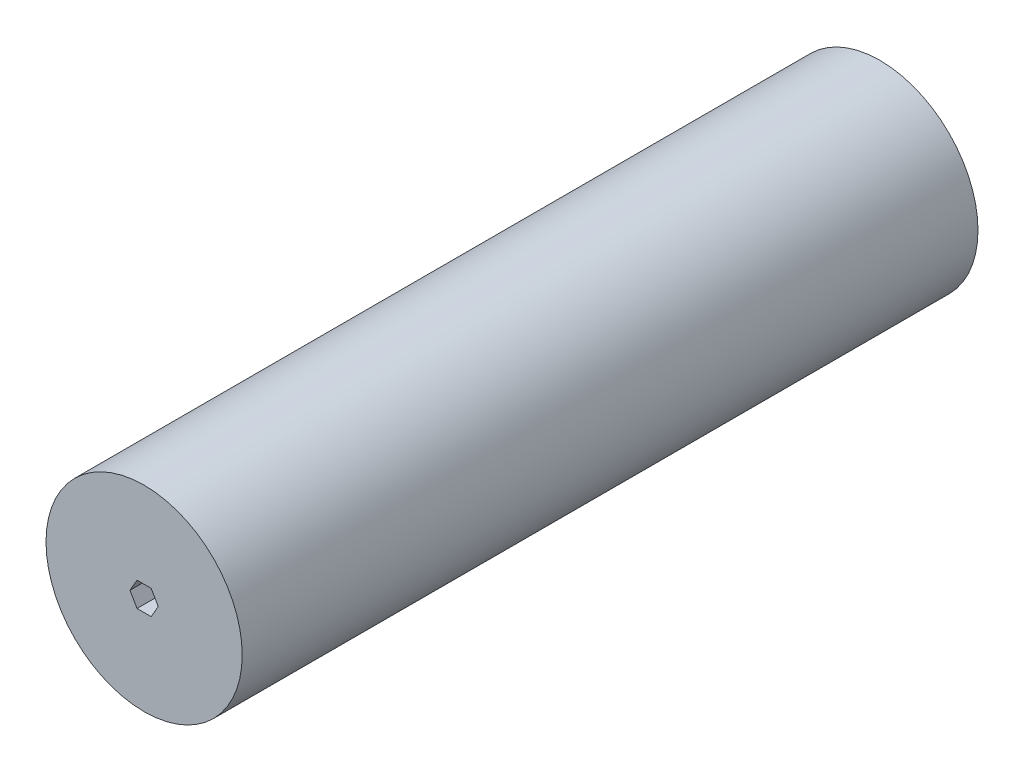
ISO-10303-21;
HEADER;
FILE_DESCRIPTION(('STEP AP214'),'2;1');
FILE_NAME('part.step','',(''),(''),'','','');
FILE_SCHEMA(('AUTOMOTIVE_DESIGN { 1 0 10303 214 1 1 1 1 }'));
ENDSEC;
DATA;
#1=APPLICATION_CONTEXT('core data for automotive mechanical design processes');
#2=APPLICATION_PROTOCOL_DEFINITION('international standard','automotive_design',2000,#1);
#3=PRODUCT_CONTEXT('',#1,'mechanical');
#4=PRODUCT('Part','Part','',(#3));
#5=PRODUCT_RELATED_PRODUCT_CATEGORY('part','',(#4));
#6=PRODUCT_DEFINITION_FORMATION('','',#4);
#7=PRODUCT_DEFINITION_CONTEXT('part definition',#1,'design');
#8=PRODUCT_DEFINITION('design','',#6,#7);
#9=PRODUCT_DEFINITION_SHAPE('','',#8);
#10=(LENGTH_UNIT() NAMED_UNIT(*) SI_UNIT(.MILLI.,.METRE.));
#11=(NAMED_UNIT(*) PLANE_ANGLE_UNIT() SI_UNIT($,.RADIAN.));
#12=(NAMED_UNIT(*) SI_UNIT($,.STERADIAN.) SOLID_ANGLE_UNIT());
#13=UNCERTAINTY_MEASURE_WITH_UNIT(LENGTH_MEASURE(1.E-05),#10,'distance_accuracy_value','');
#14=(GEOMETRIC_REPRESENTATION_CONTEXT(3) GLOBAL_UNCERTAINTY_ASSIGNED_CONTEXT((#13)) GLOBAL_UNIT_ASSIGNED_CONTEXT((#10,
#11,#12)) REPRESENTATION_CONTEXT('',''));
#15=CARTESIAN_POINT('',(0.,0.,0.));
#16=DIRECTION('',(0.,0.,1.));
#17=DIRECTION('',(1.,0.,0.));
#18=AXIS2_PLACEMENT_3D('',#15,#16,#17);
#19=CARTESIAN_POINT('',(0.,0.,380.999999999999));
#20=DIRECTION('',(0.,0.,-1.));
#21=DIRECTION('',(-1.,0.,0.));
#22=AXIS2_PLACEMENT_3D('',#19,#20,#21);
#23=CYLINDRICAL_SURFACE('',#22,50.8);
#24=CARTESIAN_POINT('',(0.,0.,380.999999999999));
#25=DIRECTION('',(0.,0.,1.));
#26=DIRECTION('',(1.,0.,0.));
#27=AXIS2_PLACEMENT_3D('',#24,#25,#26);
#28=CIRCLE('',#27,50.8);
#29=CARTESIAN_POINT('',(50.8,0.,380.999999999999));
#30=VERTEX_POINT('',#29);
#31=EDGE_CURVE('E11',#30,#30,#28,.T.);
#32=ORIENTED_EDGE('',*,*,#31,.F.);
#33=EDGE_LOOP('',(#32));
#34=FACE_BOUND('',#33,.T.);
#35=CARTESIAN_POINT('',(0.,0.,0.));
#36=DIRECTION('',(0.,0.,1.));
#37=DIRECTION('',(1.,0.,0.));
#38=AXIS2_PLACEMENT_3D('',#35,#36,#37);
#39=CIRCLE('',#38,50.8);
#40=CARTESIAN_POINT('',(50.8,0.,0.));
#41=VERTEX_POINT('',#40);
#42=EDGE_CURVE('E42',#41,#41,#39,.T.);
#43=ORIENTED_EDGE('',*,*,#42,.T.);
#44=EDGE_LOOP('',(#43));
#45=FACE_BOUND('',#44,.T.);
#46=ADVANCED_FACE('F39',(#34,#45),#23,.T.);
#47=CARTESIAN_POINT('',(0.,0.,380.999999999999));
#48=DIRECTION('',(0.,0.,1.));
#49=DIRECTION('',(1.,0.,0.));
#50=AXIS2_PLACEMENT_3D('',#47,#48,#49);
#51=PLANE('',#50);
#52=DIRECTION('',(-0.5,0.866025403784439,0.));
#53=VECTOR('',#52,1.);
#54=CARTESIAN_POINT('',(5.49926131403119,3.175,380.999999999999));
#55=LINE('',#54,#53);
#56=CARTESIAN_POINT('',(7.33234841870825,0.,380.999999999999));
#57=VERTEX_POINT('',#56);
#58=CARTESIAN_POINT('',(3.66617420935413,6.35,380.999999999999));
#59=VERTEX_POINT('',#58);
#60=EDGE_CURVE('E98',#57,#59,#55,.T.);
#61=ORIENTED_EDGE('',*,*,#60,.F.);
#62=DIRECTION('',(0.5,0.866025403784439,0.));
#63=VECTOR('',#62,1.);
#64=CARTESIAN_POINT('',(5.49926131403119,-3.175,380.999999999999));
#65=LINE('',#64,#63);
#66=CARTESIAN_POINT('',(3.66617420935413,-6.35000000000001,380.999999999999));
#67=VERTEX_POINT('',#66);
#68=EDGE_CURVE('E157',#67,#57,#65,.T.);
#69=ORIENTED_EDGE('',*,*,#68,.F.);
#70=DIRECTION('',(1.,0.,0.));
#71=VECTOR('',#70,1.);
#72=CARTESIAN_POINT('',(0.,-6.35000000000001,380.999999999999));
#73=LINE('',#72,#71);
#74=CARTESIAN_POINT('',(-3.66617420935411,-6.35000000000001,380.999999999999));
#75=VERTEX_POINT('',#74);
#76=EDGE_CURVE('E154',#75,#67,#73,.T.);
#77=ORIENTED_EDGE('',*,*,#76,.F.);
#78=DIRECTION('',(0.5,-0.866025403784439,0.));
#79=VECTOR('',#78,1.);
#80=CARTESIAN_POINT('',(-5.49926131403118,-3.175,380.999999999999));
#81=LINE('',#80,#79);
#82=CARTESIAN_POINT('',(-7.33234841870824,0.,380.999999999999));
#83=VERTEX_POINT('',#82);
#84=EDGE_CURVE('E151',#83,#75,#81,.T.);
#85=ORIENTED_EDGE('',*,*,#84,.F.);
#86=DIRECTION('',(-0.5,-0.866025403784439,0.));
#87=VECTOR('',#86,1.);
#88=CARTESIAN_POINT('',(-5.49926131403118,3.17499999999999,380.999999999999));
#89=LINE('',#88,#87);
#90=CARTESIAN_POINT('',(-3.66617420935412,6.35,380.999999999999));
#91=VERTEX_POINT('',#90);
#92=EDGE_CURVE('E148',#91,#83,#89,.T.);
#93=ORIENTED_EDGE('',*,*,#92,.F.);
#94=DIRECTION('',(-1.,0.,0.));
#95=VECTOR('',#94,1.);
#96=CARTESIAN_POINT('',(0.,6.35,380.999999999999));
#97=LINE('',#96,#95);
#98=EDGE_CURVE('E131',#59,#91,#97,.T.);
#99=ORIENTED_EDGE('',*,*,#98,.F.);
#100=EDGE_LOOP('',(#61,#69,#77,#85,#93,#99));
#101=FACE_BOUND('',#100,.T.);
#102=ORIENTED_EDGE('',*,*,#31,.T.);
#103=EDGE_LOOP('',(#102));
#104=FACE_BOUND('',#103,.T.);
#105=ADVANCED_FACE('F166',(#101,#104),#51,.T.);
#106=CARTESIAN_POINT('',(0.,0.,0.));
#107=DIRECTION('',(0.,0.,1.));
#108=DIRECTION('',(1.,0.,0.));
#109=AXIS2_PLACEMENT_3D('',#106,#107,#108);
#110=PLANE('',#109);
#111=DIRECTION('',(0.5,0.866025403784438,0.));
#112=VECTOR('',#111,1.);
#113=CARTESIAN_POINT('',(3.66617420935413,-6.35000000000001,0.));
#114=LINE('',#113,#112);
#115=CARTESIAN_POINT('',(3.66617420935413,-6.35000000000001,0.));
#116=VERTEX_POINT('',#115);
#117=CARTESIAN_POINT('',(7.33234841870825,0.,0.));
#118=VERTEX_POINT('',#117);
#119=EDGE_CURVE('E102',#116,#118,#114,.T.);
#120=ORIENTED_EDGE('',*,*,#119,.T.);
#121=DIRECTION('',(-0.5,0.866025403784438,0.));
#122=VECTOR('',#121,1.);
#123=CARTESIAN_POINT('',(7.33234841870825,0.,0.));
#124=LINE('',#123,#122);
#125=CARTESIAN_POINT('',(3.66617420935413,6.35,0.));
#126=VERTEX_POINT('',#125);
#127=EDGE_CURVE('E95',#118,#126,#124,.T.);
#128=ORIENTED_EDGE('',*,*,#127,.T.);
#129=DIRECTION('',(-1.,0.,0.));
#130=VECTOR('',#129,1.);
#131=CARTESIAN_POINT('',(3.66617420935413,6.35,0.));
#132=LINE('',#131,#130);
#133=CARTESIAN_POINT('',(-3.66617420935412,6.35,0.));
#134=VERTEX_POINT('',#133);
#135=EDGE_CURVE('E105',#126,#134,#132,.T.);
#136=ORIENTED_EDGE('',*,*,#135,.T.);
#137=DIRECTION('',(-0.5,-0.866025403784439,0.));
#138=VECTOR('',#137,1.);
#139=CARTESIAN_POINT('',(-3.66617420935412,6.35,0.));
#140=LINE('',#139,#138);
#141=CARTESIAN_POINT('',(-7.33234841870824,0.,0.));
#142=VERTEX_POINT('',#141);
#143=EDGE_CURVE('E62',#134,#142,#140,.T.);
#144=ORIENTED_EDGE('',*,*,#143,.T.);
#145=DIRECTION('',(0.5,-0.866025403784438,0.));
#146=VECTOR('',#145,1.);
#147=CARTESIAN_POINT('',(-7.33234841870824,0.,0.));
#148=LINE('',#147,#146);
#149=CARTESIAN_POINT('',(-3.66617420935411,-6.35000000000001,0.));
#150=VERTEX_POINT('',#149);
#151=EDGE_CURVE('E119',#142,#150,#148,.T.);
#152=ORIENTED_EDGE('',*,*,#151,.T.);
#153=DIRECTION('',(1.,0.,0.));
#154=VECTOR('',#153,1.);
#155=CARTESIAN_POINT('',(-3.66617420935411,-6.35000000000001,0.));
#156=LINE('',#155,#154);
#157=EDGE_CURVE('E123',#150,#116,#156,.T.);
#158=ORIENTED_EDGE('',*,*,#157,.T.);
#159=EDGE_LOOP('',(#120,#128,#136,#144,#152,#158));
#160=FACE_BOUND('',#159,.T.);
#161=ORIENTED_EDGE('',*,*,#42,.F.);
#162=EDGE_LOOP('',(#161));
#163=FACE_BOUND('',#162,.T.);
#164=ADVANCED_FACE('F110',(#160,#163),#110,.F.);
#165=CARTESIAN_POINT('',(7.33234841870825,0.,0.));
#166=DIRECTION('',(0.866025403784438,0.5,0.));
#167=DIRECTION('',(-0.5,0.866025403784439,0.));
#168=AXIS2_PLACEMENT_3D('',#165,#166,#167);
#169=PLANE('',#168);
#170=ORIENTED_EDGE('',*,*,#60,.T.);
#171=DIRECTION('',(0.,0.,1.));
#172=VECTOR('',#171,1.);
#173=CARTESIAN_POINT('',(3.66617420935413,6.35,0.));
#174=LINE('',#173,#172);
#175=EDGE_CURVE('E54',#126,#59,#174,.T.);
#176=ORIENTED_EDGE('',*,*,#175,.F.);
#177=ORIENTED_EDGE('',*,*,#127,.F.);
#178=DIRECTION('',(0.,0.,1.));
#179=VECTOR('',#178,1.);
#180=CARTESIAN_POINT('',(7.33234841870825,0.,0.));
#181=LINE('',#180,#179);
#182=EDGE_CURVE('E128',#118,#57,#181,.T.);
#183=ORIENTED_EDGE('',*,*,#182,.T.);
#184=EDGE_LOOP('',(#170,#176,#177,#183));
#185=FACE_BOUND('',#184,.T.);
#186=ADVANCED_FACE('F92',(#185),#169,.F.);
#187=CARTESIAN_POINT('',(3.66617420935413,-6.35000000000001,0.));
#188=DIRECTION('',(0.866025403784438,-0.5,0.));
#189=DIRECTION('',(0.5,0.866025403784439,0.));
#190=AXIS2_PLACEMENT_3D('',#187,#188,#189);
#191=PLANE('',#190);
#192=ORIENTED_EDGE('',*,*,#68,.T.);
#193=ORIENTED_EDGE('',*,*,#182,.F.);
#194=ORIENTED_EDGE('',*,*,#119,.F.);
#195=DIRECTION('',(0.,0.,1.));
#196=VECTOR('',#195,1.);
#197=CARTESIAN_POINT('',(3.66617420935413,-6.35000000000001,0.));
#198=LINE('',#197,#196);
#199=EDGE_CURVE('E132',#116,#67,#198,.T.);
#200=ORIENTED_EDGE('',*,*,#199,.T.);
#201=EDGE_LOOP('',(#192,#193,#194,#200));
#202=FACE_BOUND('',#201,.T.);
#203=ADVANCED_FACE('F171',(#202),#191,.F.);
#204=CARTESIAN_POINT('',(-3.66617420935411,-6.35000000000001,0.));
#205=DIRECTION('',(0.,-1.,0.));
#206=DIRECTION('',(1.,0.,0.));
#207=AXIS2_PLACEMENT_3D('',#204,#205,#206);
#208=PLANE('',#207);
#209=ORIENTED_EDGE('',*,*,#76,.T.);
#210=ORIENTED_EDGE('',*,*,#199,.F.);
#211=ORIENTED_EDGE('',*,*,#157,.F.);
#212=DIRECTION('',(0.,0.,1.));
#213=VECTOR('',#212,1.);
#214=CARTESIAN_POINT('',(-3.66617420935411,-6.35000000000001,0.));
#215=LINE('',#214,#213);
#216=EDGE_CURVE('E136',#150,#75,#215,.T.);
#217=ORIENTED_EDGE('',*,*,#216,.T.);
#218=EDGE_LOOP('',(#209,#210,#211,#217));
#219=FACE_BOUND('',#218,.T.);
#220=ADVANCED_FACE('F204',(#219),#208,.F.);
#221=CARTESIAN_POINT('',(-7.33234841870824,0.,0.));
#222=DIRECTION('',(-0.866025403784438,-0.5,0.));
#223=DIRECTION('',(0.5,-0.866025403784439,0.));
#224=AXIS2_PLACEMENT_3D('',#221,#222,#223);
#225=PLANE('',#224);
#226=ORIENTED_EDGE('',*,*,#84,.T.);
#227=ORIENTED_EDGE('',*,*,#216,.F.);
#228=ORIENTED_EDGE('',*,*,#151,.F.);
#229=DIRECTION('',(0.,0.,1.));
#230=VECTOR('',#229,1.);
#231=CARTESIAN_POINT('',(-7.33234841870824,0.,0.));
#232=LINE('',#231,#230);
#233=EDGE_CURVE('E140',#142,#83,#232,.T.);
#234=ORIENTED_EDGE('',*,*,#233,.T.);
#235=EDGE_LOOP('',(#226,#227,#228,#234));
#236=FACE_BOUND('',#235,.T.);
#237=ADVANCED_FACE('F214',(#236),#225,.F.);
#238=CARTESIAN_POINT('',(-3.66617420935412,6.35,0.));
#239=DIRECTION('',(-0.866025403784439,0.5,0.));
#240=DIRECTION('',(-0.5,-0.866025403784439,0.));
#241=AXIS2_PLACEMENT_3D('',#238,#239,#240);
#242=PLANE('',#241);
#243=ORIENTED_EDGE('',*,*,#92,.T.);
#244=ORIENTED_EDGE('',*,*,#233,.F.);
#245=ORIENTED_EDGE('',*,*,#143,.F.);
#246=DIRECTION('',(0.,0.,1.));
#247=VECTOR('',#246,1.);
#248=CARTESIAN_POINT('',(-3.66617420935412,6.35,0.));
#249=LINE('',#248,#247);
#250=EDGE_CURVE('E101',#134,#91,#249,.T.);
#251=ORIENTED_EDGE('',*,*,#250,.T.);
#252=EDGE_LOOP('',(#243,#244,#245,#251));
#253=FACE_BOUND('',#252,.T.);
#254=ADVANCED_FACE('F224',(#253),#242,.F.);
#255=CARTESIAN_POINT('',(3.66617420935413,6.35,0.));
#256=DIRECTION('',(0.,1.,0.));
#257=DIRECTION('',(0.,0.,1.));
#258=AXIS2_PLACEMENT_3D('',#255,#256,#257);
#259=PLANE('',#258);
#260=ORIENTED_EDGE('',*,*,#98,.T.);
#261=ORIENTED_EDGE('',*,*,#250,.F.);
#262=ORIENTED_EDGE('',*,*,#135,.F.);
#263=ORIENTED_EDGE('',*,*,#175,.T.);
#264=EDGE_LOOP('',(#260,#261,#262,#263));
#265=FACE_BOUND('',#264,.T.);
#266=ADVANCED_FACE('F106',(#265),#259,.F.);
#267=CLOSED_SHELL('',(#46,#105,#164,#186,#203,#220,#237,#254,#266));
#268=MANIFOLD_SOLID_BREP('B2',#267);
#269=ADVANCED_BREP_SHAPE_REPRESENTATION('',(#18,#268),#14);
#270=SHAPE_DEFINITION_REPRESENTATION(#9,#269);
ENDSEC;
END-ISO-10303-21;
